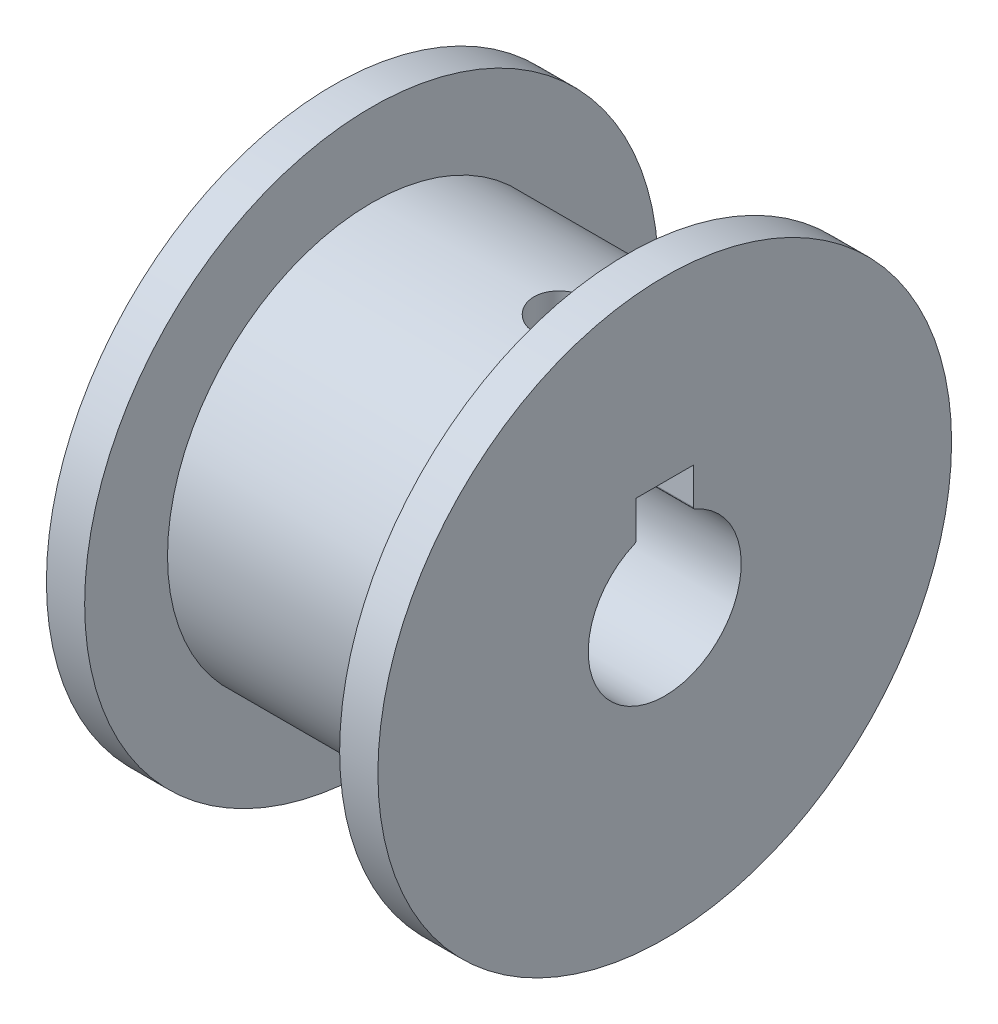
ISO-10303-21;
HEADER;
FILE_DESCRIPTION(('STEP AP214'),'2;1');
FILE_NAME('part.step','',(''),(''),'','','');
FILE_SCHEMA(('AUTOMOTIVE_DESIGN { 1 0 10303 214 1 1 1 1 }'));
ENDSEC;
DATA;
#1=APPLICATION_CONTEXT('core data for automotive mechanical design processes');
#2=APPLICATION_PROTOCOL_DEFINITION('international standard','automotive_design',2000,#1);
#3=PRODUCT_CONTEXT('',#1,'mechanical');
#4=PRODUCT('Part','Part','',(#3));
#5=PRODUCT_RELATED_PRODUCT_CATEGORY('part','',(#4));
#6=PRODUCT_DEFINITION_FORMATION('','',#4);
#7=PRODUCT_DEFINITION_CONTEXT('part definition',#1,'design');
#8=PRODUCT_DEFINITION('design','',#6,#7);
#9=PRODUCT_DEFINITION_SHAPE('','',#8);
#10=(LENGTH_UNIT() NAMED_UNIT(*) SI_UNIT(.MILLI.,.METRE.));
#11=(NAMED_UNIT(*) PLANE_ANGLE_UNIT() SI_UNIT($,.RADIAN.));
#12=(NAMED_UNIT(*) SI_UNIT($,.STERADIAN.) SOLID_ANGLE_UNIT());
#13=UNCERTAINTY_MEASURE_WITH_UNIT(LENGTH_MEASURE(1.E-05),#10,'distance_accuracy_value','');
#14=(GEOMETRIC_REPRESENTATION_CONTEXT(3) GLOBAL_UNCERTAINTY_ASSIGNED_CONTEXT((#13)) GLOBAL_UNIT_ASSIGNED_CONTEXT((#10,
#11,#12)) REPRESENTATION_CONTEXT('',''));
#15=CARTESIAN_POINT('',(0.,0.,0.));
#16=DIRECTION('',(0.,0.,1.));
#17=DIRECTION('',(1.,0.,0.));
#18=AXIS2_PLACEMENT_3D('',#15,#16,#17);
#19=CARTESIAN_POINT('',(23.,8.56214886532175,2.25));
#20=DIRECTION('',(0.,-1.,0.));
#21=DIRECTION('',(0.,0.,-1.));
#22=AXIS2_PLACEMENT_3D('',#19,#20,#21);
#23=PLANE('',#22);
#24=CARTESIAN_POINT('',(15.,8.56214886532175,0.));
#25=DIRECTION('',(0.,-1.,0.));
#26=DIRECTION('',(0.,0.,-1.));
#27=AXIS2_PLACEMENT_3D('',#24,#25,#26);
#28=CIRCLE('',#27,2.25);
#29=CARTESIAN_POINT('',(15.,8.56214886532175,-2.25));
#30=VERTEX_POINT('',#29);
#31=CARTESIAN_POINT('',(15.,8.56214886532175,2.25));
#32=VERTEX_POINT('',#31);
#33=EDGE_CURVE('E48',#30,#32,#28,.T.);
#34=ORIENTED_EDGE('',*,*,#33,.F.);
#35=DIRECTION('',(-1.,0.,0.));
#36=VECTOR('',#35,1.);
#37=CARTESIAN_POINT('',(23.,8.56214886532175,-2.25));
#38=LINE('',#37,#36);
#39=CARTESIAN_POINT('',(23.,8.56214886532175,-2.25));
#40=VERTEX_POINT('',#39);
#41=EDGE_CURVE('E100',#40,#30,#38,.T.);
#42=ORIENTED_EDGE('',*,*,#41,.F.);
#43=DIRECTION('',(0.,0.,1.));
#44=VECTOR('',#43,1.);
#45=CARTESIAN_POINT('',(23.,8.56214886532175,2.25));
#46=LINE('',#45,#44);
#47=CARTESIAN_POINT('',(23.,8.56214886532175,2.25));
#48=VERTEX_POINT('',#47);
#49=EDGE_CURVE('E183',#40,#48,#46,.T.);
#50=ORIENTED_EDGE('',*,*,#49,.T.);
#51=DIRECTION('',(-1.,0.,0.));
#52=VECTOR('',#51,1.);
#53=CARTESIAN_POINT('',(23.,8.56214886532175,2.25));
#54=LINE('',#53,#52);
#55=EDGE_CURVE('E56',#48,#32,#54,.T.);
#56=ORIENTED_EDGE('',*,*,#55,.T.);
#57=EDGE_LOOP('',(#34,#42,#50,#56));
#58=FACE_BOUND('',#57,.T.);
#59=ADVANCED_FACE('F33',(#58),#23,.T.);
#60=CARTESIAN_POINT('',(23.,0.,0.));
#61=DIRECTION('',(1.,0.,0.));
#62=DIRECTION('',(0.,0.,-1.));
#63=AXIS2_PLACEMENT_3D('',#60,#61,#62);
#64=PLANE('',#63);
#65=CARTESIAN_POINT('',(23.,0.,0.));
#66=DIRECTION('',(1.,0.,0.));
#67=DIRECTION('',(0.,0.,-1.));
#68=AXIS2_PLACEMENT_3D('',#65,#66,#67);
#69=CIRCLE('',#68,22.5);
#70=CARTESIAN_POINT('',(23.,0.,-22.5));
#71=VERTEX_POINT('',#70);
#72=EDGE_CURVE('E134',#71,#71,#69,.T.);
#73=ORIENTED_EDGE('',*,*,#72,.T.);
#74=EDGE_LOOP('',(#73));
#75=FACE_BOUND('',#74,.T.);
#76=CARTESIAN_POINT('',(23.,0.,0.));
#77=DIRECTION('',(1.,0.,0.));
#78=DIRECTION('',(0.,0.,-1.));
#79=AXIS2_PLACEMENT_3D('',#76,#77,#78);
#80=CIRCLE('',#79,6.);
#81=CARTESIAN_POINT('',(23.,5.51167052414251,2.37096774193548));
#82=VERTEX_POINT('',#81);
#83=CARTESIAN_POINT('',(23.,5.51167052414251,-2.37096774193548));
#84=VERTEX_POINT('',#83);
#85=EDGE_CURVE('E170',#82,#84,#80,.T.);
#86=ORIENTED_EDGE('',*,*,#85,.F.);
#87=CARTESIAN_POINT('',(23.,5.69539287494726,2.45));
#88=DIRECTION('',(-1.,0.,0.));
#89=DIRECTION('',(0.,0.,-1.));
#90=AXIS2_PLACEMENT_3D('',#87,#88,#89);
#91=CIRCLE('',#90,0.2);
#92=CARTESIAN_POINT('',(23.,5.69539287494726,2.25));
#93=VERTEX_POINT('',#92);
#94=EDGE_CURVE('E166',#93,#82,#91,.T.);
#95=ORIENTED_EDGE('',*,*,#94,.F.);
#96=DIRECTION('',(0.,-1.,0.));
#97=VECTOR('',#96,1.);
#98=CARTESIAN_POINT('',(23.,8.56214886532175,2.25));
#99=LINE('',#98,#97);
#100=EDGE_CURVE('E185',#48,#93,#99,.T.);
#101=ORIENTED_EDGE('',*,*,#100,.F.);
#102=ORIENTED_EDGE('',*,*,#49,.F.);
#103=DIRECTION('',(0.,1.,0.));
#104=VECTOR('',#103,1.);
#105=CARTESIAN_POINT('',(23.,8.56214886532175,-2.25));
#106=LINE('',#105,#104);
#107=CARTESIAN_POINT('',(23.,5.69539287494726,-2.25));
#108=VERTEX_POINT('',#107);
#109=EDGE_CURVE('E114',#108,#40,#106,.T.);
#110=ORIENTED_EDGE('',*,*,#109,.F.);
#111=CARTESIAN_POINT('',(23.,5.69539287494726,-2.45));
#112=DIRECTION('',(-1.,0.,0.));
#113=DIRECTION('',(0.,0.,1.));
#114=AXIS2_PLACEMENT_3D('',#111,#112,#113);
#115=CIRCLE('',#114,0.2);
#116=EDGE_CURVE('E172',#84,#108,#115,.T.);
#117=ORIENTED_EDGE('',*,*,#116,.F.);
#118=EDGE_LOOP('',(#86,#95,#101,#102,#110,#117));
#119=FACE_BOUND('',#118,.T.);
#120=ADVANCED_FACE('F192',(#75,#119),#64,.T.);
#121=CARTESIAN_POINT('',(-3.,0.,0.));
#122=DIRECTION('',(-1.,0.,0.));
#123=DIRECTION('',(0.,0.,1.));
#124=AXIS2_PLACEMENT_3D('',#121,#122,#123);
#125=PLANE('',#124);
#126=CARTESIAN_POINT('',(-3.,0.,0.));
#127=DIRECTION('',(-1.,0.,0.));
#128=DIRECTION('',(0.,0.,1.));
#129=AXIS2_PLACEMENT_3D('',#126,#127,#128);
#130=CIRCLE('',#129,22.5);
#131=CARTESIAN_POINT('',(-3.,0.,22.5));
#132=VERTEX_POINT('',#131);
#133=EDGE_CURVE('E128',#132,#132,#130,.T.);
#134=ORIENTED_EDGE('',*,*,#133,.T.);
#135=EDGE_LOOP('',(#134));
#136=FACE_BOUND('',#135,.T.);
#137=DIRECTION('',(0.,-1.,0.));
#138=VECTOR('',#137,1.);
#139=CARTESIAN_POINT('',(-3.,0.,2.25));
#140=LINE('',#139,#138);
#141=CARTESIAN_POINT('',(-3.,8.56214886532175,2.25));
#142=VERTEX_POINT('',#141);
#143=CARTESIAN_POINT('',(-3.,5.69539287494726,2.25));
#144=VERTEX_POINT('',#143);
#145=EDGE_CURVE('E143',#142,#144,#140,.T.);
#146=ORIENTED_EDGE('',*,*,#145,.T.);
#147=CARTESIAN_POINT('',(-3.,5.69539287494726,2.45));
#148=DIRECTION('',(-1.,0.,0.));
#149=DIRECTION('',(0.,0.,1.));
#150=AXIS2_PLACEMENT_3D('',#147,#148,#149);
#151=CIRCLE('',#150,0.2);
#152=CARTESIAN_POINT('',(-3.,5.51167052414251,2.37096774193548));
#153=VERTEX_POINT('',#152);
#154=EDGE_CURVE('E11',#144,#153,#151,.T.);
#155=ORIENTED_EDGE('',*,*,#154,.T.);
#156=CARTESIAN_POINT('',(-3.,0.,0.));
#157=DIRECTION('',(-1.,0.,0.));
#158=DIRECTION('',(0.,0.,1.));
#159=AXIS2_PLACEMENT_3D('',#156,#157,#158);
#160=CIRCLE('',#159,6.);
#161=CARTESIAN_POINT('',(-3.,5.51167052414251,-2.37096774193548));
#162=VERTEX_POINT('',#161);
#163=EDGE_CURVE('E42',#153,#162,#160,.F.);
#164=ORIENTED_EDGE('',*,*,#163,.T.);
#165=CARTESIAN_POINT('',(-3.,5.69539287494726,-2.45));
#166=DIRECTION('',(-1.,0.,0.));
#167=DIRECTION('',(0.,0.,1.));
#168=AXIS2_PLACEMENT_3D('',#165,#166,#167);
#169=CIRCLE('',#168,0.2);
#170=CARTESIAN_POINT('',(-3.,5.69539287494726,-2.25));
#171=VERTEX_POINT('',#170);
#172=EDGE_CURVE('E151',#162,#171,#169,.T.);
#173=ORIENTED_EDGE('',*,*,#172,.T.);
#174=DIRECTION('',(0.,1.,0.));
#175=VECTOR('',#174,1.);
#176=CARTESIAN_POINT('',(-3.,0.,-2.25));
#177=LINE('',#176,#175);
#178=CARTESIAN_POINT('',(-3.,8.56214886532175,-2.25));
#179=VERTEX_POINT('',#178);
#180=EDGE_CURVE('E149',#171,#179,#177,.T.);
#181=ORIENTED_EDGE('',*,*,#180,.T.);
#182=DIRECTION('',(0.,0.,1.));
#183=VECTOR('',#182,1.);
#184=CARTESIAN_POINT('',(-3.,8.56214886532175,0.));
#185=LINE('',#184,#183);
#186=EDGE_CURVE('E107',#179,#142,#185,.T.);
#187=ORIENTED_EDGE('',*,*,#186,.T.);
#188=EDGE_LOOP('',(#146,#155,#164,#173,#181,#187));
#189=FACE_BOUND('',#188,.T.);
#190=ADVANCED_FACE('F155',(#136,#189),#125,.T.);
#191=CARTESIAN_POINT('',(20.,0.,0.));
#192=DIRECTION('',(-1.,0.,0.));
#193=DIRECTION('',(0.,0.,1.));
#194=AXIS2_PLACEMENT_3D('',#191,#192,#193);
#195=CYLINDRICAL_SURFACE('',#194,16.);
#196=CARTESIAN_POINT('',(15.,15.8410069124409,-2.25));
#197=CARTESIAN_POINT('',(15.1257112639483,15.8410089081729,-2.24999474342947));
#198=CARTESIAN_POINT('',(15.2514977229745,15.8425195223386,-2.2394288550088));
#199=CARTESIAN_POINT('',(15.4995602119092,15.8483953893365,-2.19745203429434));
#200=CARTESIAN_POINT('',(15.6218325926619,15.8527635051042,-2.16602019590312));
#201=CARTESIAN_POINT('',(15.8592400229507,15.8638500608594,-2.08326491139205));
#202=CARTESIAN_POINT('',(15.9743802273906,15.8705667794595,-2.03195603100621));
#203=CARTESIAN_POINT('',(16.1943983018213,15.885591683378,-1.9109362691313));
#204=CARTESIAN_POINT('',(16.2992777160054,15.893899628667,-1.84122816248298));
#205=CARTESIAN_POINT('',(16.4965548263848,15.9112364190484,-1.68486330074313));
#206=CARTESIAN_POINT('',(16.5888696910024,15.9202694775891,-1.59810249619271));
#207=CARTESIAN_POINT('',(16.7576803067199,15.9380009854541,-1.41031953418243));
#208=CARTESIAN_POINT('',(16.8341752215571,15.9466994170699,-1.30929662328425));
#209=CARTESIAN_POINT('',(16.9694770552021,15.9628253431961,-1.0953300893493));
#210=CARTESIAN_POINT('',(17.0282081749283,15.9702473345896,-0.98233808465556));
#211=CARTESIAN_POINT('',(17.1258292086919,15.9829375863097,-0.747972123274437));
#212=CARTESIAN_POINT('',(17.164720047062,15.988205946969,-0.626598557372169));
#213=CARTESIAN_POINT('',(17.2213067685259,15.995965627228,-0.379765928544714));
#214=CARTESIAN_POINT('',(17.2391410286317,15.9984750699481,-0.254339167652389));
#215=CARTESIAN_POINT('',(17.2535376909213,16.0004961959771,-0.00224984813562289));
#216=CARTESIAN_POINT('',(17.2501011389959,16.0000080266791,0.124412649421608));
#217=CARTESIAN_POINT('',(17.222163599055,15.9961034839159,0.374434907346476));
#218=CARTESIAN_POINT('',(17.1978114615597,15.9927078029429,0.497811669163785));
#219=CARTESIAN_POINT('',(17.1289672845496,15.9833928711551,0.738709936903845));
#220=CARTESIAN_POINT('',(17.0844747787448,15.9774735619134,0.856231307192613));
#221=CARTESIAN_POINT('',(16.976458132332,15.963740819617,1.08253739306393));
#222=CARTESIAN_POINT('',(16.9128706367653,15.9559210979462,1.19129147199088));
#223=CARTESIAN_POINT('',(16.7685152108708,15.9392603840045,1.39664172673147));
#224=CARTESIAN_POINT('',(16.6877462849479,15.9304193325652,1.49323719748594));
#225=CARTESIAN_POINT('',(16.510489721048,15.9126130810366,1.67240453975174));
#226=CARTESIAN_POINT('',(16.4138722108505,15.9036474684679,1.75484793583819));
#227=CARTESIAN_POINT('',(16.2081042619541,15.8866774848383,1.90236950041857));
#228=CARTESIAN_POINT('',(16.09895376272,15.8786731184207,1.96744758503184));
#229=CARTESIAN_POINT('',(15.8710920221739,15.8645321452428,2.07840456378241));
#230=CARTESIAN_POINT('',(15.7523748366462,15.8583967112282,2.12427140970475));
#231=CARTESIAN_POINT('',(15.5088170941902,15.8487098283916,2.19538076539843));
#232=CARTESIAN_POINT('',(15.38397691474,15.8451582204918,2.22062454487701));
#233=CARTESIAN_POINT('',(15.1328566820462,15.8410708982118,2.24959739520312));
#234=CARTESIAN_POINT('',(15.0065979801198,15.8405097285105,2.25350806533883));
#235=CARTESIAN_POINT('',(14.7552270988476,15.8423993445024,2.24018448166861));
#236=CARTESIAN_POINT('',(14.6301148884609,15.8448500484054,2.2229508020572));
#237=CARTESIAN_POINT('',(14.3851437646074,15.852463959838,2.16798130456132));
#238=CARTESIAN_POINT('',(14.2652643756471,15.8576153274531,2.13033495289238));
#239=CARTESIAN_POINT('',(14.0335181637284,15.870040445815,2.03570143098876));
#240=CARTESIAN_POINT('',(13.921651692203,15.8773142895791,1.97871341308926));
#241=CARTESIAN_POINT('',(13.7082897386343,15.893225159777,1.84657390560512));
#242=CARTESIAN_POINT('',(13.6068680997483,15.9018709221316,1.77130425321169));
#243=CARTESIAN_POINT('',(13.4180316551212,15.9195247335585,1.60490346130614));
#244=CARTESIAN_POINT('',(13.3306175432143,15.9285328005492,1.51377153655502));
#245=CARTESIAN_POINT('',(13.1716309801038,15.9459752711394,1.31743587820575));
#246=CARTESIAN_POINT('',(13.1001784777816,15.9544050215183,1.21213454003844));
#247=CARTESIAN_POINT('',(12.9759768253092,15.9696698626717,0.990918522100777));
#248=CARTESIAN_POINT('',(12.9232272151235,15.9765049926677,0.875004103468958));
#249=CARTESIAN_POINT('',(12.8381229240552,15.98778997372,0.636236294269141));
#250=CARTESIAN_POINT('',(12.8057011873193,15.992247659938,0.513407190330823));
#251=CARTESIAN_POINT('',(12.7619554861979,15.9983082490425,0.2639811530467));
#252=CARTESIAN_POINT('',(12.7506303041224,15.999911316697,0.137384437595451));
#253=CARTESIAN_POINT('',(12.7494261548163,16.0000807434014,-0.114816789334162));
#254=CARTESIAN_POINT('',(12.759363102998,15.9986731682216,-0.240420443571329));
#255=CARTESIAN_POINT('',(12.8000084217627,15.9930317137591,-0.488152644661289));
#256=CARTESIAN_POINT('',(12.8307167483066,15.9887978404686,-0.610281198881347));
#257=CARTESIAN_POINT('',(12.9119707144374,15.9779772553502,-0.847556228145429));
#258=CARTESIAN_POINT('',(12.9625051421592,15.9713918735133,-0.962706607004464));
#259=CARTESIAN_POINT('',(13.0819574991086,15.9565939039091,-1.18292248576823));
#260=CARTESIAN_POINT('',(13.1508758779883,15.9483812763423,-1.28798773891592));
#261=CARTESIAN_POINT('',(13.305811809612,15.931158588744,-1.48598755439916));
#262=CARTESIAN_POINT('',(13.3919657633614,15.9221425078889,-1.57881486705197));
#263=CARTESIAN_POINT('',(13.5786408793837,15.9043751169355,-1.74876321423906));
#264=CARTESIAN_POINT('',(13.6791654182834,15.8956238696517,-1.82588054707524));
#265=CARTESIAN_POINT('',(13.8923033621773,15.8793311061746,-1.9625540301866));
#266=CARTESIAN_POINT('',(14.0049736317512,15.8717957327667,-2.02202220858805));
#267=CARTESIAN_POINT('',(14.2387515521241,15.8588598092358,-2.12110448801386));
#268=CARTESIAN_POINT('',(14.3598501242873,15.8534570026116,-2.16073958667663));
#269=CARTESIAN_POINT('',(14.5679389345775,15.8466715624536,-2.20983855018776));
#270=CARTESIAN_POINT('',(14.6536324291918,15.8445583070607,-2.22487660764752));
#271=CARTESIAN_POINT('',(14.8262053094346,15.8417252995657,-2.24495909647484));
#272=CARTESIAN_POINT('',(14.9130846824167,15.8410055326148,-2.25000363433222));
#273=CARTESIAN_POINT('',(15.,15.8410069124409,-2.25));
#274=B_SPLINE_CURVE_WITH_KNOTS('',3,(#196,#197,#198,#199,#200,#201,#202,#203,#204,#205,#206,
#207,#208,#209,#210,#211,#212,#213,#214,#215,#216,#217,#218,#219,#220,#221,#222,#223,#224,#225,
#226,#227,#228,#229,#230,#231,#232,#233,#234,#235,#236,#237,#238,#239,#240,#241,#242,#243,#244,
#245,#246,#247,#248,#249,#250,#251,#252,#253,#254,#255,#256,#257,#258,#259,#260,#261,#262,#263,
#264,#265,#266,#267,#268,#269,#270,#271,#272,#273),.UNSPECIFIED.,.T.,.F.,(4,2,2,2,2,2,2,2,2,2,2,
2,2,2,2,2,2,2,2,2,2,2,2,2,2,2,2,2,2,2,2,2,2,2,2,2,2,2,4),(0.,0.376816176291968,0.75401046474186,
1.13092886954738,1.50779046264079,1.88702721450565,2.26628400818558,2.64713699330607,
3.02797223336486,3.40629056534979,3.78459029548498,4.16021986899139,4.5358581395202,
4.91275676934171,5.28967724488195,5.66985673226218,6.05003805601206,6.43045745252186,
6.81085342585783,7.18800614456382,7.56514862156337,7.94065133577995,8.3161705088451,
8.69418463798318,9.07221748549258,9.45300216436986,9.83377747642445,10.2132900179685,
10.592780653424,10.9689990130259,11.3452165749796,11.7212216879756,12.0972359985039,
12.4763529825216,12.8555591937405,13.2366249747313,13.6172864563851,13.8778155895899,
14.138341946611),.UNSPECIFIED.);
#275=CARTESIAN_POINT('',(15.,15.8410069124409,-2.25));
#276=VERTEX_POINT('',#275);
#277=EDGE_CURVE('E102',#276,#276,#274,.T.);
#278=ORIENTED_EDGE('',*,*,#277,.T.);
#279=EDGE_LOOP('',(#278));
#280=FACE_BOUND('',#279,.T.);
#281=CARTESIAN_POINT('',(20.,0.,0.));
#282=DIRECTION('',(1.,0.,0.));
#283=DIRECTION('',(0.,0.,-1.));
#284=AXIS2_PLACEMENT_3D('',#281,#282,#283);
#285=CIRCLE('',#284,16.);
#286=CARTESIAN_POINT('',(20.,0.,-16.));
#287=VERTEX_POINT('',#286);
#288=EDGE_CURVE('E137',#287,#287,#285,.T.);
#289=ORIENTED_EDGE('',*,*,#288,.F.);
#290=EDGE_LOOP('',(#289));
#291=FACE_BOUND('',#290,.T.);
#292=CARTESIAN_POINT('',(0.,0.,0.));
#293=DIRECTION('',(1.,0.,0.));
#294=DIRECTION('',(0.,0.,-1.));
#295=AXIS2_PLACEMENT_3D('',#292,#293,#294);
#296=CIRCLE('',#295,16.);
#297=CARTESIAN_POINT('',(0.,0.,-16.));
#298=VERTEX_POINT('',#297);
#299=EDGE_CURVE('E131',#298,#298,#296,.T.);
#300=ORIENTED_EDGE('',*,*,#299,.T.);
#301=EDGE_LOOP('',(#300));
#302=FACE_BOUND('',#301,.T.);
#303=ADVANCED_FACE('F35',(#280,#291,#302),#195,.T.);
#304=CARTESIAN_POINT('',(23.,0.,0.));
#305=DIRECTION('',(-1.,0.,0.));
#306=DIRECTION('',(0.,0.,1.));
#307=AXIS2_PLACEMENT_3D('',#304,#305,#306);
#308=CYLINDRICAL_SURFACE('',#307,22.5);
#309=ORIENTED_EDGE('',*,*,#72,.F.);
#310=EDGE_LOOP('',(#309));
#311=FACE_BOUND('',#310,.T.);
#312=CARTESIAN_POINT('',(20.,0.,0.));
#313=DIRECTION('',(1.,0.,0.));
#314=DIRECTION('',(0.,0.,-1.));
#315=AXIS2_PLACEMENT_3D('',#312,#313,#314);
#316=CIRCLE('',#315,22.5);
#317=CARTESIAN_POINT('',(20.,0.,-22.5));
#318=VERTEX_POINT('',#317);
#319=EDGE_CURVE('E138',#318,#318,#316,.T.);
#320=ORIENTED_EDGE('',*,*,#319,.T.);
#321=EDGE_LOOP('',(#320));
#322=FACE_BOUND('',#321,.T.);
#323=ADVANCED_FACE('F209',(#311,#322),#308,.T.);
#324=CARTESIAN_POINT('',(20.,0.,0.));
#325=DIRECTION('',(1.,0.,0.));
#326=DIRECTION('',(0.,0.,-1.));
#327=AXIS2_PLACEMENT_3D('',#324,#325,#326);
#328=PLANE('',#327);
#329=ORIENTED_EDGE('',*,*,#288,.T.);
#330=EDGE_LOOP('',(#329));
#331=FACE_BOUND('',#330,.T.);
#332=ORIENTED_EDGE('',*,*,#319,.F.);
#333=EDGE_LOOP('',(#332));
#334=FACE_BOUND('',#333,.T.);
#335=ADVANCED_FACE('F207',(#331,#334),#328,.F.);
#336=CARTESIAN_POINT('',(-3.,0.,0.));
#337=DIRECTION('',(1.,0.,0.));
#338=DIRECTION('',(0.,0.,-1.));
#339=AXIS2_PLACEMENT_3D('',#336,#337,#338);
#340=CYLINDRICAL_SURFACE('',#339,22.5);
#341=ORIENTED_EDGE('',*,*,#133,.F.);
#342=EDGE_LOOP('',(#341));
#343=FACE_BOUND('',#342,.T.);
#344=CARTESIAN_POINT('',(0.,0.,0.));
#345=DIRECTION('',(-1.,0.,0.));
#346=DIRECTION('',(0.,0.,1.));
#347=AXIS2_PLACEMENT_3D('',#344,#345,#346);
#348=CIRCLE('',#347,22.5);
#349=CARTESIAN_POINT('',(0.,0.,22.5));
#350=VERTEX_POINT('',#349);
#351=EDGE_CURVE('E127',#350,#350,#348,.T.);
#352=ORIENTED_EDGE('',*,*,#351,.T.);
#353=EDGE_LOOP('',(#352));
#354=FACE_BOUND('',#353,.T.);
#355=ADVANCED_FACE('F205',(#343,#354),#340,.T.);
#356=CARTESIAN_POINT('',(0.,0.,0.));
#357=DIRECTION('',(-1.,0.,0.));
#358=DIRECTION('',(0.,0.,1.));
#359=AXIS2_PLACEMENT_3D('',#356,#357,#358);
#360=PLANE('',#359);
#361=ORIENTED_EDGE('',*,*,#299,.F.);
#362=EDGE_LOOP('',(#361));
#363=FACE_BOUND('',#362,.T.);
#364=ORIENTED_EDGE('',*,*,#351,.F.);
#365=EDGE_LOOP('',(#364));
#366=FACE_BOUND('',#365,.T.);
#367=ADVANCED_FACE('F229',(#363,#366),#360,.F.);
#368=CARTESIAN_POINT('',(23.,5.69539287494726,2.45));
#369=DIRECTION('',(-1.,0.,0.));
#370=DIRECTION('',(0.,0.,1.));
#371=AXIS2_PLACEMENT_3D('',#368,#369,#370);
#372=CYLINDRICAL_SURFACE('',#371,0.2);
#373=DIRECTION('',(-1.,0.,0.));
#374=VECTOR('',#373,1.);
#375=CARTESIAN_POINT('',(23.,5.69539287494726,2.25));
#376=LINE('',#375,#374);
#377=EDGE_CURVE('E167',#93,#144,#376,.T.);
#378=ORIENTED_EDGE('',*,*,#377,.F.);
#379=ORIENTED_EDGE('',*,*,#94,.T.);
#380=DIRECTION('',(-1.,0.,0.));
#381=VECTOR('',#380,1.);
#382=CARTESIAN_POINT('',(23.,5.51167052414251,2.37096774193548));
#383=LINE('',#382,#381);
#384=EDGE_CURVE('E124',#82,#153,#383,.T.);
#385=ORIENTED_EDGE('',*,*,#384,.T.);
#386=ORIENTED_EDGE('',*,*,#154,.F.);
#387=EDGE_LOOP('',(#378,#379,#385,#386));
#388=FACE_BOUND('',#387,.T.);
#389=ADVANCED_FACE('F164',(#388),#372,.T.);
#390=CARTESIAN_POINT('',(23.,0.,0.));
#391=DIRECTION('',(-1.,0.,0.));
#392=DIRECTION('',(0.,0.,1.));
#393=AXIS2_PLACEMENT_3D('',#390,#391,#392);
#394=CYLINDRICAL_SURFACE('',#393,6.);
#395=ORIENTED_EDGE('',*,*,#384,.F.);
#396=ORIENTED_EDGE('',*,*,#85,.T.);
#397=DIRECTION('',(-1.,0.,0.));
#398=VECTOR('',#397,1.);
#399=CARTESIAN_POINT('',(23.,5.51167052414251,-2.37096774193548));
#400=LINE('',#399,#398);
#401=EDGE_CURVE('E117',#84,#162,#400,.T.);
#402=ORIENTED_EDGE('',*,*,#401,.T.);
#403=ORIENTED_EDGE('',*,*,#163,.F.);
#404=EDGE_LOOP('',(#395,#396,#402,#403));
#405=FACE_BOUND('',#404,.T.);
#406=ADVANCED_FACE('F159',(#405),#394,.F.);
#407=CARTESIAN_POINT('',(23.,5.69539287494726,-2.45));
#408=DIRECTION('',(-1.,0.,0.));
#409=DIRECTION('',(0.,0.,1.));
#410=AXIS2_PLACEMENT_3D('',#407,#408,#409);
#411=CYLINDRICAL_SURFACE('',#410,0.2);
#412=ORIENTED_EDGE('',*,*,#401,.F.);
#413=ORIENTED_EDGE('',*,*,#116,.T.);
#414=DIRECTION('',(-1.,0.,0.));
#415=VECTOR('',#414,1.);
#416=CARTESIAN_POINT('',(23.,5.69539287494726,-2.25));
#417=LINE('',#416,#415);
#418=EDGE_CURVE('E115',#108,#171,#417,.T.);
#419=ORIENTED_EDGE('',*,*,#418,.T.);
#420=ORIENTED_EDGE('',*,*,#172,.F.);
#421=EDGE_LOOP('',(#412,#413,#419,#420));
#422=FACE_BOUND('',#421,.T.);
#423=ADVANCED_FACE('F190',(#422),#411,.T.);
#424=CARTESIAN_POINT('',(23.,8.56214886532175,-2.25));
#425=DIRECTION('',(0.,0.,1.));
#426=DIRECTION('',(0.,-1.,0.));
#427=AXIS2_PLACEMENT_3D('',#424,#425,#426);
#428=PLANE('',#427);
#429=ORIENTED_EDGE('',*,*,#418,.F.);
#430=ORIENTED_EDGE('',*,*,#109,.T.);
#431=ORIENTED_EDGE('',*,*,#41,.T.);
#432=EDGE_CURVE('E104',#30,#179,#38,.T.);
#433=ORIENTED_EDGE('',*,*,#432,.T.);
#434=ORIENTED_EDGE('',*,*,#180,.F.);
#435=EDGE_LOOP('',(#429,#430,#431,#433,#434));
#436=FACE_BOUND('',#435,.T.);
#437=ADVANCED_FACE('F112',(#436),#428,.T.);
#438=EDGE_CURVE('E91',#32,#30,#28,.T.);
#439=ORIENTED_EDGE('',*,*,#438,.F.);
#440=EDGE_CURVE('E186',#32,#142,#54,.T.);
#441=ORIENTED_EDGE('',*,*,#440,.T.);
#442=ORIENTED_EDGE('',*,*,#186,.F.);
#443=ORIENTED_EDGE('',*,*,#432,.F.);
#444=EDGE_LOOP('',(#439,#441,#442,#443));
#445=FACE_BOUND('',#444,.T.);
#446=ADVANCED_FACE('F105',(#445),#23,.T.);
#447=CARTESIAN_POINT('',(23.,8.56214886532175,2.25));
#448=DIRECTION('',(0.,0.,-1.));
#449=DIRECTION('',(0.,1.,0.));
#450=AXIS2_PLACEMENT_3D('',#447,#448,#449);
#451=PLANE('',#450);
#452=ORIENTED_EDGE('',*,*,#55,.F.);
#453=ORIENTED_EDGE('',*,*,#100,.T.);
#454=ORIENTED_EDGE('',*,*,#377,.T.);
#455=ORIENTED_EDGE('',*,*,#145,.F.);
#456=ORIENTED_EDGE('',*,*,#440,.F.);
#457=EDGE_LOOP('',(#452,#453,#454,#455,#456));
#458=FACE_BOUND('',#457,.T.);
#459=ADVANCED_FACE('F188',(#458),#451,.T.);
#460=CARTESIAN_POINT('',(15.,18.5621488653217,0.));
#461=DIRECTION('',(0.,-1.,0.));
#462=DIRECTION('',(0.,0.,-1.));
#463=AXIS2_PLACEMENT_3D('',#460,#461,#462);
#464=CYLINDRICAL_SURFACE('',#463,2.25);
#465=ORIENTED_EDGE('',*,*,#33,.T.);
#466=ORIENTED_EDGE('',*,*,#438,.T.);
#467=EDGE_LOOP('',(#465,#466));
#468=FACE_BOUND('',#467,.T.);
#469=ORIENTED_EDGE('',*,*,#277,.F.);
#470=EDGE_LOOP('',(#469));
#471=FACE_BOUND('',#470,.T.);
#472=ADVANCED_FACE('F92',(#468,#471),#464,.F.);
#473=CLOSED_SHELL('',(#59,#120,#190,#303,#323,#335,#355,#367,#389,#406,#423,#437,#446,#459,#472));
#474=MANIFOLD_SOLID_BREP('B2',#473);
#475=ADVANCED_BREP_SHAPE_REPRESENTATION('',(#18,#474),#14);
#476=SHAPE_DEFINITION_REPRESENTATION(#9,#475);
ENDSEC;
END-ISO-10303-21;
